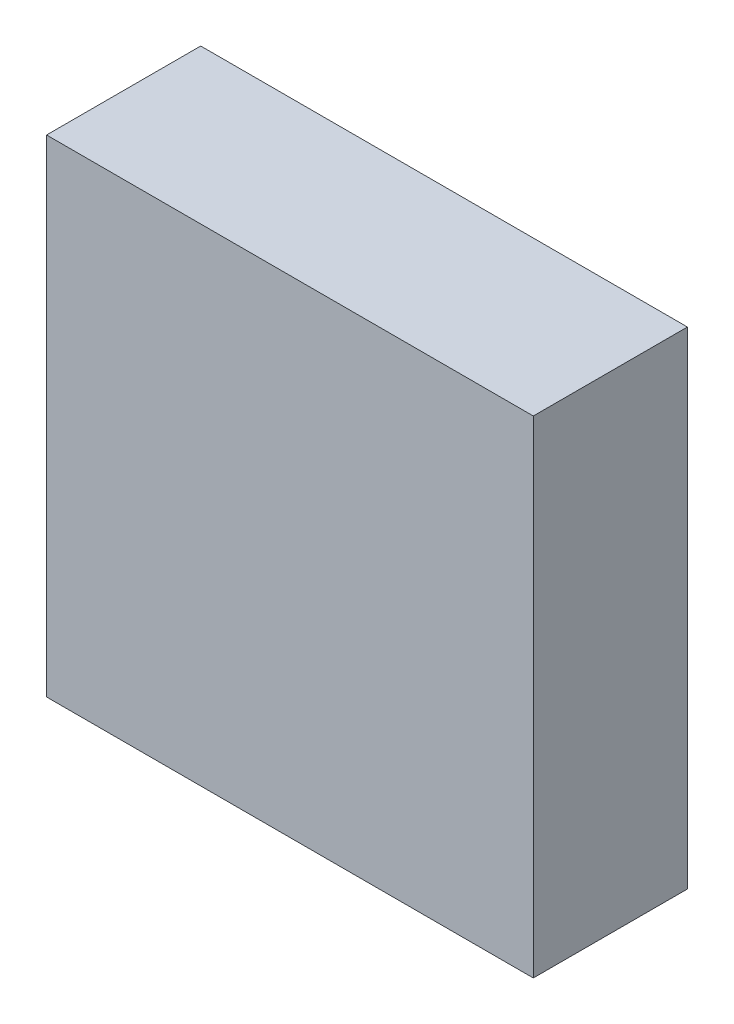
ISO-10303-21;
HEADER;
FILE_DESCRIPTION(('STEP AP214'),'2;1');
FILE_NAME('part.step','',(''),(''),'','','');
FILE_SCHEMA(('AUTOMOTIVE_DESIGN { 1 0 10303 214 1 1 1 1 }'));
ENDSEC;
DATA;
#1=APPLICATION_CONTEXT('core data for automotive mechanical design processes');
#2=APPLICATION_PROTOCOL_DEFINITION('international standard','automotive_design',2000,#1);
#3=PRODUCT_CONTEXT('',#1,'mechanical');
#4=PRODUCT('Part','Part','',(#3));
#5=PRODUCT_RELATED_PRODUCT_CATEGORY('part','',(#4));
#6=PRODUCT_DEFINITION_FORMATION('','',#4);
#7=PRODUCT_DEFINITION_CONTEXT('part definition',#1,'design');
#8=PRODUCT_DEFINITION('design','',#6,#7);
#9=PRODUCT_DEFINITION_SHAPE('','',#8);
#10=(LENGTH_UNIT() NAMED_UNIT(*) SI_UNIT(.MILLI.,.METRE.));
#11=(NAMED_UNIT(*) PLANE_ANGLE_UNIT() SI_UNIT($,.RADIAN.));
#12=(NAMED_UNIT(*) SI_UNIT($,.STERADIAN.) SOLID_ANGLE_UNIT());
#13=UNCERTAINTY_MEASURE_WITH_UNIT(LENGTH_MEASURE(1.E-05),#10,'distance_accuracy_value','');
#14=(GEOMETRIC_REPRESENTATION_CONTEXT(3) GLOBAL_UNCERTAINTY_ASSIGNED_CONTEXT((#13)) GLOBAL_UNIT_ASSIGNED_CONTEXT((#10,
#11,#12)) REPRESENTATION_CONTEXT('',''));
#15=CARTESIAN_POINT('',(0.,0.,0.));
#16=DIRECTION('',(0.,0.,1.));
#17=DIRECTION('',(1.,0.,0.));
#18=AXIS2_PLACEMENT_3D('',#15,#16,#17);
#19=CARTESIAN_POINT('',(0.,0.,4.75));
#20=DIRECTION('',(1.,0.,0.));
#21=DIRECTION('',(0.,0.,-1.));
#22=AXIS2_PLACEMENT_3D('',#19,#20,#21);
#23=PLANE('',#22);
#24=DIRECTION('',(0.,-1.,0.));
#25=VECTOR('',#24,1.);
#26=CARTESIAN_POINT('',(0.,0.,0.));
#27=LINE('',#26,#25);
#28=CARTESIAN_POINT('',(0.,15.,0.));
#29=VERTEX_POINT('',#28);
#30=CARTESIAN_POINT('',(0.,0.,0.));
#31=VERTEX_POINT('',#30);
#32=EDGE_CURVE('E95',#29,#31,#27,.T.);
#33=ORIENTED_EDGE('',*,*,#32,.T.);
#34=DIRECTION('',(0.,0.,-1.));
#35=VECTOR('',#34,1.);
#36=CARTESIAN_POINT('',(0.,0.,4.75));
#37=LINE('',#36,#35);
#38=CARTESIAN_POINT('',(0.,0.,4.75));
#39=VERTEX_POINT('',#38);
#40=EDGE_CURVE('E11',#39,#31,#37,.T.);
#41=ORIENTED_EDGE('',*,*,#40,.F.);
#42=DIRECTION('',(0.,-1.,0.));
#43=VECTOR('',#42,1.);
#44=CARTESIAN_POINT('',(0.,0.,4.75));
#45=LINE('',#44,#43);
#46=CARTESIAN_POINT('',(0.,15.,4.75));
#47=VERTEX_POINT('',#46);
#48=EDGE_CURVE('E83',#47,#39,#45,.T.);
#49=ORIENTED_EDGE('',*,*,#48,.F.);
#50=DIRECTION('',(0.,0.,-1.));
#51=VECTOR('',#50,1.);
#52=CARTESIAN_POINT('',(0.,15.,4.75));
#53=LINE('',#52,#51);
#54=EDGE_CURVE('E91',#47,#29,#53,.T.);
#55=ORIENTED_EDGE('',*,*,#54,.T.);
#56=EDGE_LOOP('',(#33,#41,#49,#55));
#57=FACE_BOUND('',#56,.T.);
#58=ADVANCED_FACE('F32',(#57),#23,.F.);
#59=CARTESIAN_POINT('',(0.,0.,4.75));
#60=DIRECTION('',(0.,1.,0.));
#61=DIRECTION('',(0.,0.,1.));
#62=AXIS2_PLACEMENT_3D('',#59,#60,#61);
#63=PLANE('',#62);
#64=DIRECTION('',(1.,0.,0.));
#65=VECTOR('',#64,1.);
#66=CARTESIAN_POINT('',(0.,0.,0.));
#67=LINE('',#66,#65);
#68=CARTESIAN_POINT('',(15.,0.,0.));
#69=VERTEX_POINT('',#68);
#70=EDGE_CURVE('E87',#31,#69,#67,.T.);
#71=ORIENTED_EDGE('',*,*,#70,.T.);
#72=DIRECTION('',(0.,0.,-1.));
#73=VECTOR('',#72,1.);
#74=CARTESIAN_POINT('',(15.,0.,4.75));
#75=LINE('',#74,#73);
#76=CARTESIAN_POINT('',(15.,0.,4.75));
#77=VERTEX_POINT('',#76);
#78=EDGE_CURVE('E40',#77,#69,#75,.T.);
#79=ORIENTED_EDGE('',*,*,#78,.F.);
#80=DIRECTION('',(1.,0.,0.));
#81=VECTOR('',#80,1.);
#82=CARTESIAN_POINT('',(0.,0.,4.75));
#83=LINE('',#82,#81);
#84=EDGE_CURVE('E78',#39,#77,#83,.T.);
#85=ORIENTED_EDGE('',*,*,#84,.F.);
#86=ORIENTED_EDGE('',*,*,#40,.T.);
#87=EDGE_LOOP('',(#71,#79,#85,#86));
#88=FACE_BOUND('',#87,.T.);
#89=ADVANCED_FACE('F86',(#88),#63,.F.);
#90=CARTESIAN_POINT('',(15.,0.,4.75));
#91=DIRECTION('',(-1.,0.,0.));
#92=DIRECTION('',(0.,-1.,0.));
#93=AXIS2_PLACEMENT_3D('',#90,#91,#92);
#94=PLANE('',#93);
#95=DIRECTION('',(0.,1.,0.));
#96=VECTOR('',#95,1.);
#97=CARTESIAN_POINT('',(15.,0.,0.));
#98=LINE('',#97,#96);
#99=CARTESIAN_POINT('',(15.,15.,0.));
#100=VERTEX_POINT('',#99);
#101=EDGE_CURVE('E65',#69,#100,#98,.T.);
#102=ORIENTED_EDGE('',*,*,#101,.T.);
#103=DIRECTION('',(0.,0.,-1.));
#104=VECTOR('',#103,1.);
#105=CARTESIAN_POINT('',(15.,15.,4.75));
#106=LINE('',#105,#104);
#107=CARTESIAN_POINT('',(15.,15.,4.75));
#108=VERTEX_POINT('',#107);
#109=EDGE_CURVE('E88',#108,#100,#106,.T.);
#110=ORIENTED_EDGE('',*,*,#109,.F.);
#111=DIRECTION('',(0.,1.,0.));
#112=VECTOR('',#111,1.);
#113=CARTESIAN_POINT('',(15.,0.,4.75));
#114=LINE('',#113,#112);
#115=EDGE_CURVE('E81',#77,#108,#114,.T.);
#116=ORIENTED_EDGE('',*,*,#115,.F.);
#117=ORIENTED_EDGE('',*,*,#78,.T.);
#118=EDGE_LOOP('',(#102,#110,#116,#117));
#119=FACE_BOUND('',#118,.T.);
#120=ADVANCED_FACE('F89',(#119),#94,.F.);
#121=CARTESIAN_POINT('',(0.,15.,4.75));
#122=DIRECTION('',(0.,-1.,0.));
#123=DIRECTION('',(0.,0.,-1.));
#124=AXIS2_PLACEMENT_3D('',#121,#122,#123);
#125=PLANE('',#124);
#126=DIRECTION('',(-1.,0.,0.));
#127=VECTOR('',#126,1.);
#128=CARTESIAN_POINT('',(0.,15.,0.));
#129=LINE('',#128,#127);
#130=EDGE_CURVE('E71',#100,#29,#129,.T.);
#131=ORIENTED_EDGE('',*,*,#130,.T.);
#132=ORIENTED_EDGE('',*,*,#54,.F.);
#133=DIRECTION('',(-1.,0.,0.));
#134=VECTOR('',#133,1.);
#135=CARTESIAN_POINT('',(0.,15.,4.75));
#136=LINE('',#135,#134);
#137=EDGE_CURVE('E48',#108,#47,#136,.T.);
#138=ORIENTED_EDGE('',*,*,#137,.F.);
#139=ORIENTED_EDGE('',*,*,#109,.T.);
#140=EDGE_LOOP('',(#131,#132,#138,#139));
#141=FACE_BOUND('',#140,.T.);
#142=ADVANCED_FACE('F102',(#141),#125,.F.);
#143=CARTESIAN_POINT('',(0.,0.,4.75));
#144=DIRECTION('',(0.,0.,-1.));
#145=DIRECTION('',(-1.,0.,0.));
#146=AXIS2_PLACEMENT_3D('',#143,#144,#145);
#147=PLANE('',#146);
#148=ORIENTED_EDGE('',*,*,#48,.T.);
#149=ORIENTED_EDGE('',*,*,#84,.T.);
#150=ORIENTED_EDGE('',*,*,#115,.T.);
#151=ORIENTED_EDGE('',*,*,#137,.T.);
#152=EDGE_LOOP('',(#148,#149,#150,#151));
#153=FACE_BOUND('',#152,.T.);
#154=ADVANCED_FACE('F79',(#153),#147,.F.);
#155=CARTESIAN_POINT('',(0.,0.,0.));
#156=DIRECTION('',(0.,0.,-1.));
#157=DIRECTION('',(-1.,0.,0.));
#158=AXIS2_PLACEMENT_3D('',#155,#156,#157);
#159=PLANE('',#158);
#160=ORIENTED_EDGE('',*,*,#32,.F.);
#161=ORIENTED_EDGE('',*,*,#130,.F.);
#162=ORIENTED_EDGE('',*,*,#101,.F.);
#163=ORIENTED_EDGE('',*,*,#70,.F.);
#164=EDGE_LOOP('',(#160,#161,#162,#163));
#165=FACE_BOUND('',#164,.T.);
#166=ADVANCED_FACE('F105',(#165),#159,.T.);
#167=CLOSED_SHELL('',(#58,#89,#120,#142,#154,#166));
#168=MANIFOLD_SOLID_BREP('B2',#167);
#169=ADVANCED_BREP_SHAPE_REPRESENTATION('',(#18,#168),#14);
#170=SHAPE_DEFINITION_REPRESENTATION(#9,#169);
ENDSEC;
END-ISO-10303-21;
